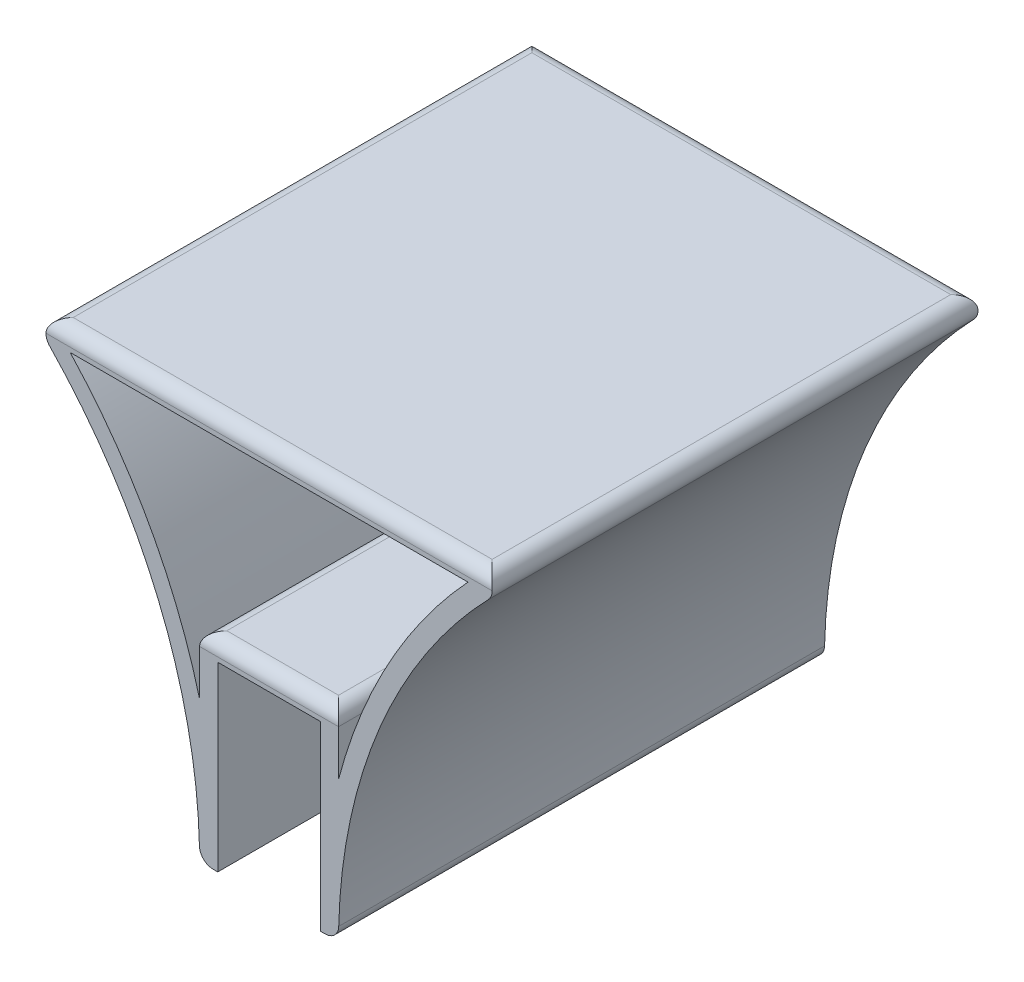
ISO-10303-21;
HEADER;
FILE_DESCRIPTION(('STEP AP214'),'2;1');
FILE_NAME('part.step','',(''),(''),'','','');
FILE_SCHEMA(('AUTOMOTIVE_DESIGN { 1 0 10303 214 1 1 1 1 }'));
ENDSEC;
DATA;
#1=APPLICATION_CONTEXT('core data for automotive mechanical design processes');
#2=APPLICATION_PROTOCOL_DEFINITION('international standard','automotive_design',2000,#1);
#3=PRODUCT_CONTEXT('',#1,'mechanical');
#4=PRODUCT('Part','Part','',(#3));
#5=PRODUCT_RELATED_PRODUCT_CATEGORY('part','',(#4));
#6=PRODUCT_DEFINITION_FORMATION('','',#4);
#7=PRODUCT_DEFINITION_CONTEXT('part definition',#1,'design');
#8=PRODUCT_DEFINITION('design','',#6,#7);
#9=PRODUCT_DEFINITION_SHAPE('','',#8);
#10=(LENGTH_UNIT() NAMED_UNIT(*) SI_UNIT(.MILLI.,.METRE.));
#11=(NAMED_UNIT(*) PLANE_ANGLE_UNIT() SI_UNIT($,.RADIAN.));
#12=(NAMED_UNIT(*) SI_UNIT($,.STERADIAN.) SOLID_ANGLE_UNIT());
#13=UNCERTAINTY_MEASURE_WITH_UNIT(LENGTH_MEASURE(1.E-05),#10,'distance_accuracy_value','');
#14=(GEOMETRIC_REPRESENTATION_CONTEXT(3) GLOBAL_UNCERTAINTY_ASSIGNED_CONTEXT((#13)) GLOBAL_UNIT_ASSIGNED_CONTEXT((#10,
#11,#12)) REPRESENTATION_CONTEXT('',''));
#15=CARTESIAN_POINT('',(0.,0.,0.));
#16=DIRECTION('',(0.,0.,1.));
#17=DIRECTION('',(1.,0.,0.));
#18=AXIS2_PLACEMENT_3D('',#15,#16,#17);
#19=CARTESIAN_POINT('',(11.3,0.,-53.5));
#20=DIRECTION('',(-1.,0.,0.));
#21=DIRECTION('',(0.,-1.,0.));
#22=AXIS2_PLACEMENT_3D('',#19,#20,#21);
#23=PLANE('',#22);
#24=DIRECTION('',(0.,-1.,0.));
#25=VECTOR('',#24,1.);
#26=CARTESIAN_POINT('',(11.3,0.,53.5));
#27=LINE('',#26,#25);
#28=CARTESIAN_POINT('',(11.3,0.,53.5));
#29=VERTEX_POINT('',#28);
#30=CARTESIAN_POINT('',(11.3,-40.,53.5));
#31=VERTEX_POINT('',#30);
#32=EDGE_CURVE('E235',#29,#31,#27,.T.);
#33=ORIENTED_EDGE('',*,*,#32,.F.);
#34=DIRECTION('',(0.,0.,1.));
#35=VECTOR('',#34,1.);
#36=CARTESIAN_POINT('',(11.3,0.,-53.5));
#37=LINE('',#36,#35);
#38=CARTESIAN_POINT('',(11.3,0.,-53.5));
#39=VERTEX_POINT('',#38);
#40=EDGE_CURVE('E279',#39,#29,#37,.T.);
#41=ORIENTED_EDGE('',*,*,#40,.F.);
#42=DIRECTION('',(0.,-1.,0.));
#43=VECTOR('',#42,1.);
#44=CARTESIAN_POINT('',(11.3,0.,-53.5));
#45=LINE('',#44,#43);
#46=CARTESIAN_POINT('',(11.3,-40.,-53.5));
#47=VERTEX_POINT('',#46);
#48=EDGE_CURVE('E239',#39,#47,#45,.T.);
#49=ORIENTED_EDGE('',*,*,#48,.T.);
#50=DIRECTION('',(0.,0.,1.));
#51=VECTOR('',#50,1.);
#52=CARTESIAN_POINT('',(11.3,-40.,-53.5));
#53=LINE('',#52,#51);
#54=EDGE_CURVE('E260',#47,#31,#53,.T.);
#55=ORIENTED_EDGE('',*,*,#54,.T.);
#56=EDGE_LOOP('',(#33,#41,#49,#55));
#57=FACE_BOUND('',#56,.T.);
#58=ADVANCED_FACE('F37',(#57),#23,.T.);
#59=CARTESIAN_POINT('',(-11.3,0.,-53.5));
#60=DIRECTION('',(0.,-1.,0.));
#61=DIRECTION('',(0.,0.,-1.));
#62=AXIS2_PLACEMENT_3D('',#59,#60,#61);
#63=PLANE('',#62);
#64=DIRECTION('',(1.,0.,0.));
#65=VECTOR('',#64,1.);
#66=CARTESIAN_POINT('',(-11.3,0.,53.5));
#67=LINE('',#66,#65);
#68=CARTESIAN_POINT('',(-11.3,0.,53.5));
#69=VERTEX_POINT('',#68);
#70=EDGE_CURVE('E243',#69,#29,#67,.T.);
#71=ORIENTED_EDGE('',*,*,#70,.F.);
#72=DIRECTION('',(0.,0.,1.));
#73=VECTOR('',#72,1.);
#74=CARTESIAN_POINT('',(-11.3,0.,-53.5));
#75=LINE('',#74,#73);
#76=CARTESIAN_POINT('',(-11.3,0.,-53.5));
#77=VERTEX_POINT('',#76);
#78=EDGE_CURVE('E282',#77,#69,#75,.T.);
#79=ORIENTED_EDGE('',*,*,#78,.F.);
#80=DIRECTION('',(1.,0.,0.));
#81=VECTOR('',#80,1.);
#82=CARTESIAN_POINT('',(-11.3,0.,-53.5));
#83=LINE('',#82,#81);
#84=EDGE_CURVE('E257',#77,#39,#83,.T.);
#85=ORIENTED_EDGE('',*,*,#84,.T.);
#86=ORIENTED_EDGE('',*,*,#40,.T.);
#87=EDGE_LOOP('',(#71,#79,#85,#86));
#88=FACE_BOUND('',#87,.T.);
#89=ADVANCED_FACE('F390',(#88),#63,.T.);
#90=CARTESIAN_POINT('',(-11.3,0.,-53.5));
#91=DIRECTION('',(1.,0.,0.));
#92=DIRECTION('',(0.,1.,0.));
#93=AXIS2_PLACEMENT_3D('',#90,#91,#92);
#94=PLANE('',#93);
#95=DIRECTION('',(0.,1.,0.));
#96=VECTOR('',#95,1.);
#97=CARTESIAN_POINT('',(-11.3,0.,53.5));
#98=LINE('',#97,#96);
#99=CARTESIAN_POINT('',(-11.3,-40.,53.5));
#100=VERTEX_POINT('',#99);
#101=EDGE_CURVE('E274',#100,#69,#98,.T.);
#102=ORIENTED_EDGE('',*,*,#101,.F.);
#103=DIRECTION('',(0.,0.,1.));
#104=VECTOR('',#103,1.);
#105=CARTESIAN_POINT('',(-11.3,-40.,-53.5));
#106=LINE('',#105,#104);
#107=CARTESIAN_POINT('',(-11.3,-40.,-53.5));
#108=VERTEX_POINT('',#107);
#109=EDGE_CURVE('E284',#108,#100,#106,.T.);
#110=ORIENTED_EDGE('',*,*,#109,.F.);
#111=DIRECTION('',(0.,1.,0.));
#112=VECTOR('',#111,1.);
#113=CARTESIAN_POINT('',(-11.3,0.,-53.5));
#114=LINE('',#113,#112);
#115=EDGE_CURVE('E254',#108,#77,#114,.T.);
#116=ORIENTED_EDGE('',*,*,#115,.T.);
#117=ORIENTED_EDGE('',*,*,#78,.T.);
#118=EDGE_LOOP('',(#102,#110,#116,#117));
#119=FACE_BOUND('',#118,.T.);
#120=ADVANCED_FACE('F394',(#119),#94,.T.);
#121=CARTESIAN_POINT('',(-11.3,-40.,-53.5));
#122=DIRECTION('',(0.,-1.,0.));
#123=DIRECTION('',(0.,0.,-1.));
#124=AXIS2_PLACEMENT_3D('',#121,#122,#123);
#125=PLANE('',#124);
#126=DIRECTION('',(1.,0.,0.));
#127=VECTOR('',#126,1.);
#128=CARTESIAN_POINT('',(-11.3,-40.,53.5));
#129=LINE('',#128,#127);
#130=CARTESIAN_POINT('',(-12.3372621005481,-40.,53.5));
#131=VERTEX_POINT('',#130);
#132=EDGE_CURVE('E272',#131,#100,#129,.T.);
#133=ORIENTED_EDGE('',*,*,#132,.F.);
#134=DIRECTION('',(0.,0.,1.));
#135=VECTOR('',#134,1.);
#136=CARTESIAN_POINT('',(-12.3372621005481,-40.,-53.5));
#137=LINE('',#136,#135);
#138=CARTESIAN_POINT('',(-12.3372621005481,-40.,-53.5));
#139=VERTEX_POINT('',#138);
#140=EDGE_CURVE('E46',#131,#139,#137,.F.);
#141=ORIENTED_EDGE('',*,*,#140,.T.);
#142=DIRECTION('',(1.,0.,0.));
#143=VECTOR('',#142,1.);
#144=CARTESIAN_POINT('',(-11.3,-40.,-53.5));
#145=LINE('',#144,#143);
#146=EDGE_CURVE('E252',#139,#108,#145,.T.);
#147=ORIENTED_EDGE('',*,*,#146,.T.);
#148=ORIENTED_EDGE('',*,*,#109,.T.);
#149=EDGE_LOOP('',(#133,#141,#147,#148));
#150=FACE_BOUND('',#149,.T.);
#151=ADVANCED_FACE('F492',(#150),#125,.T.);
#152=CARTESIAN_POINT('',(-133.084769668458,-40.,-53.5));
#153=DIRECTION('',(0.,0.,1.));
#154=DIRECTION('',(1.,0.,0.));
#155=AXIS2_PLACEMENT_3D('',#152,#153,#154);
#156=CYLINDRICAL_SURFACE('',#155,117.784769668458);
#157=CARTESIAN_POINT('',(-133.084769668458,-40.,53.5));
#158=DIRECTION('',(0.,0.,-1.));
#159=DIRECTION('',(1.,0.,0.));
#160=AXIS2_PLACEMENT_3D('',#157,#158,#159);
#161=CIRCLE('',#160,117.784769668458);
#162=CARTESIAN_POINT('',(-48.2880934679172,41.7482456765426,53.5));
#163=VERTEX_POINT('',#162);
#164=CARTESIAN_POINT('',(-15.3363366005704,-37.0745127057385,53.5));
#165=VERTEX_POINT('',#164);
#166=EDGE_CURVE('E269',#163,#165,#161,.T.);
#167=ORIENTED_EDGE('',*,*,#166,.F.);
#168=DIRECTION('',(0.,0.,1.));
#169=VECTOR('',#168,1.);
#170=CARTESIAN_POINT('',(-48.2880934679172,41.7482456765426,-53.5));
#171=LINE('',#170,#169);
#172=CARTESIAN_POINT('',(-48.2880934679172,41.7482456765426,-53.5));
#173=VERTEX_POINT('',#172);
#174=EDGE_CURVE('E334',#163,#173,#171,.F.);
#175=ORIENTED_EDGE('',*,*,#174,.T.);
#176=CARTESIAN_POINT('',(-133.084769668458,-40.,-53.5));
#177=DIRECTION('',(0.,0.,-1.));
#178=DIRECTION('',(1.,0.,0.));
#179=AXIS2_PLACEMENT_3D('',#176,#177,#178);
#180=CIRCLE('',#179,117.784769668458);
#181=CARTESIAN_POINT('',(-15.3363366005704,-37.0745127057385,-53.5));
#182=VERTEX_POINT('',#181);
#183=EDGE_CURVE('E249',#173,#182,#180,.T.);
#184=ORIENTED_EDGE('',*,*,#183,.T.);
#185=DIRECTION('',(0.,0.,1.));
#186=VECTOR('',#185,1.);
#187=CARTESIAN_POINT('',(-15.3363366005704,-37.0745127057385,-53.5));
#188=LINE('',#187,#186);
#189=EDGE_CURVE('E331',#182,#165,#188,.T.);
#190=ORIENTED_EDGE('',*,*,#189,.T.);
#191=EDGE_LOOP('',(#167,#175,#184,#190));
#192=FACE_BOUND('',#191,.T.);
#193=ADVANCED_FACE('F404',(#192),#156,.F.);
#194=CARTESIAN_POINT('',(53.5,46.8303887050508,-53.5));
#195=DIRECTION('',(0.,1.,0.));
#196=DIRECTION('',(0.,0.,1.));
#197=AXIS2_PLACEMENT_3D('',#194,#195,#196);
#198=PLANE('',#197);
#199=DIRECTION('',(-1.,0.,0.));
#200=VECTOR('',#199,1.);
#201=CARTESIAN_POINT('',(53.5,46.8303887050508,-50.5));
#202=LINE('',#201,#200);
#203=CARTESIAN_POINT('',(46.1283063467327,46.8303887050508,-50.5));
#204=VERTEX_POINT('',#203);
#205=CARTESIAN_POINT('',(-46.1283063467327,46.8303887050508,-50.5));
#206=VERTEX_POINT('',#205);
#207=EDGE_CURVE('E54',#204,#206,#202,.T.);
#208=ORIENTED_EDGE('',*,*,#207,.T.);
#209=DIRECTION('',(0.,0.,1.));
#210=VECTOR('',#209,1.);
#211=CARTESIAN_POINT('',(-46.1283063467327,46.8303887050508,-53.5));
#212=LINE('',#211,#210);
#213=CARTESIAN_POINT('',(-46.1283063467327,46.8303887050508,50.5));
#214=VERTEX_POINT('',#213);
#215=EDGE_CURVE('E329',#206,#214,#212,.T.);
#216=ORIENTED_EDGE('',*,*,#215,.T.);
#217=DIRECTION('',(-1.,0.,0.));
#218=VECTOR('',#217,1.);
#219=CARTESIAN_POINT('',(53.5,46.8303887050508,50.5));
#220=LINE('',#219,#218);
#221=CARTESIAN_POINT('',(46.1283063467327,46.8303887050508,50.5));
#222=VERTEX_POINT('',#221);
#223=EDGE_CURVE('E325',#214,#222,#220,.F.);
#224=ORIENTED_EDGE('',*,*,#223,.T.);
#225=DIRECTION('',(0.,0.,1.));
#226=VECTOR('',#225,1.);
#227=CARTESIAN_POINT('',(46.1283063467327,46.8303887050508,-53.5));
#228=LINE('',#227,#226);
#229=EDGE_CURVE('E59',#222,#204,#228,.F.);
#230=ORIENTED_EDGE('',*,*,#229,.T.);
#231=EDGE_LOOP('',(#208,#216,#224,#230));
#232=FACE_BOUND('',#231,.T.);
#233=ADVANCED_FACE('F414',(#232),#198,.T.);
#234=CARTESIAN_POINT('',(133.084769668458,-40.,-53.5));
#235=DIRECTION('',(0.,0.,1.));
#236=DIRECTION('',(1.,0.,0.));
#237=AXIS2_PLACEMENT_3D('',#234,#235,#236);
#238=CYLINDRICAL_SURFACE('',#237,117.784769668458);
#239=CARTESIAN_POINT('',(133.084769668458,-40.,-53.5));
#240=DIRECTION('',(0.,0.,-1.));
#241=DIRECTION('',(-1.,0.,0.));
#242=AXIS2_PLACEMENT_3D('',#239,#240,#241);
#243=CIRCLE('',#242,117.784769668458);
#244=CARTESIAN_POINT('',(15.3363366005704,-37.0745127057385,-53.5));
#245=VERTEX_POINT('',#244);
#246=CARTESIAN_POINT('',(48.2880934679172,41.7482456765426,-53.5));
#247=VERTEX_POINT('',#246);
#248=EDGE_CURVE('E246',#245,#247,#243,.T.);
#249=ORIENTED_EDGE('',*,*,#248,.T.);
#250=DIRECTION('',(0.,0.,1.));
#251=VECTOR('',#250,1.);
#252=CARTESIAN_POINT('',(48.2880934679172,41.7482456765426,-53.5));
#253=LINE('',#252,#251);
#254=CARTESIAN_POINT('',(48.2880934679172,41.7482456765426,53.5));
#255=VERTEX_POINT('',#254);
#256=EDGE_CURVE('E339',#247,#255,#253,.T.);
#257=ORIENTED_EDGE('',*,*,#256,.T.);
#258=CARTESIAN_POINT('',(133.084769668458,-40.,53.5));
#259=DIRECTION('',(0.,0.,-1.));
#260=DIRECTION('',(-1.,0.,0.));
#261=AXIS2_PLACEMENT_3D('',#258,#259,#260);
#262=CIRCLE('',#261,117.784769668458);
#263=CARTESIAN_POINT('',(15.3363366005704,-37.0745127057385,53.5));
#264=VERTEX_POINT('',#263);
#265=EDGE_CURVE('E266',#264,#255,#262,.T.);
#266=ORIENTED_EDGE('',*,*,#265,.F.);
#267=DIRECTION('',(0.,0.,1.));
#268=VECTOR('',#267,1.);
#269=CARTESIAN_POINT('',(15.3363366005704,-37.0745127057385,-53.5));
#270=LINE('',#269,#268);
#271=EDGE_CURVE('E337',#264,#245,#270,.F.);
#272=ORIENTED_EDGE('',*,*,#271,.T.);
#273=EDGE_LOOP('',(#249,#257,#266,#272));
#274=FACE_BOUND('',#273,.T.);
#275=ADVANCED_FACE('F374',(#274),#238,.F.);
#276=CARTESIAN_POINT('',(11.3,-40.,-53.5));
#277=DIRECTION('',(0.,-1.,0.));
#278=DIRECTION('',(0.,0.,-1.));
#279=AXIS2_PLACEMENT_3D('',#276,#277,#278);
#280=PLANE('',#279);
#281=DIRECTION('',(1.,0.,0.));
#282=VECTOR('',#281,1.);
#283=CARTESIAN_POINT('',(11.3,-40.,-53.5));
#284=LINE('',#283,#282);
#285=CARTESIAN_POINT('',(12.3372621005481,-40.,-53.5));
#286=VERTEX_POINT('',#285);
#287=EDGE_CURVE('E242',#47,#286,#284,.T.);
#288=ORIENTED_EDGE('',*,*,#287,.T.);
#289=DIRECTION('',(0.,0.,1.));
#290=VECTOR('',#289,1.);
#291=CARTESIAN_POINT('',(12.3372621005481,-40.,-53.5));
#292=LINE('',#291,#290);
#293=CARTESIAN_POINT('',(12.3372621005481,-40.,53.5));
#294=VERTEX_POINT('',#293);
#295=EDGE_CURVE('E11',#286,#294,#292,.T.);
#296=ORIENTED_EDGE('',*,*,#295,.T.);
#297=DIRECTION('',(1.,0.,0.));
#298=VECTOR('',#297,1.);
#299=CARTESIAN_POINT('',(11.3,-40.,53.5));
#300=LINE('',#299,#298);
#301=EDGE_CURVE('E263',#31,#294,#300,.T.);
#302=ORIENTED_EDGE('',*,*,#301,.F.);
#303=ORIENTED_EDGE('',*,*,#54,.F.);
#304=EDGE_LOOP('',(#288,#296,#302,#303));
#305=FACE_BOUND('',#304,.T.);
#306=ADVANCED_FACE('F382',(#305),#280,.T.);
#307=CARTESIAN_POINT('',(133.084769668458,-40.,-53.5));
#308=DIRECTION('',(0.,0.,-1.));
#309=DIRECTION('',(-1.,0.,0.));
#310=AXIS2_PLACEMENT_3D('',#307,#308,#309);
#311=PLANE('',#310);
#312=DIRECTION('',(0.,1.,0.));
#313=VECTOR('',#312,1.);
#314=CARTESIAN_POINT('',(-15.3,4.,-53.5));
#315=LINE('',#314,#313);
#316=CARTESIAN_POINT('',(-15.3,-9.04393181704647,-53.5));
#317=VERTEX_POINT('',#316);
#318=CARTESIAN_POINT('',(-15.3,1.,-53.5));
#319=VERTEX_POINT('',#318);
#320=EDGE_CURVE('E221',#317,#319,#315,.T.);
#321=ORIENTED_EDGE('',*,*,#320,.T.);
#322=DIRECTION('',(1.,0.,0.));
#323=VECTOR('',#322,1.);
#324=CARTESIAN_POINT('',(15.3,1.,-53.5));
#325=LINE('',#324,#323);
#326=CARTESIAN_POINT('',(15.3,1.,-53.5));
#327=VERTEX_POINT('',#326);
#328=EDGE_CURVE('E309',#319,#327,#325,.T.);
#329=ORIENTED_EDGE('',*,*,#328,.T.);
#330=DIRECTION('',(0.,-1.,0.));
#331=VECTOR('',#330,1.);
#332=CARTESIAN_POINT('',(15.3,4.,-53.5));
#333=LINE('',#332,#331);
#334=CARTESIAN_POINT('',(15.3,-9.04393181704647,-53.5));
#335=VERTEX_POINT('',#334);
#336=EDGE_CURVE('E200',#327,#335,#333,.T.);
#337=ORIENTED_EDGE('',*,*,#336,.T.);
#338=CARTESIAN_POINT('',(133.084769668458,-40.,-53.5));
#339=DIRECTION('',(0.,0.,-1.));
#340=DIRECTION('',(-1.,0.,0.));
#341=AXIS2_PLACEMENT_3D('',#338,#339,#340);
#342=CIRCLE('',#341,121.784769668458);
#343=CARTESIAN_POINT('',(43.8062345652789,42.8303887050508,-53.5));
#344=VERTEX_POINT('',#343);
#345=EDGE_CURVE('E193',#335,#344,#342,.T.);
#346=ORIENTED_EDGE('',*,*,#345,.T.);
#347=DIRECTION('',(-1.,0.,0.));
#348=VECTOR('',#347,1.);
#349=CARTESIAN_POINT('',(43.8062345652789,42.8303887050508,-53.5));
#350=LINE('',#349,#348);
#351=CARTESIAN_POINT('',(-43.8062345652789,42.8303887050508,-53.5));
#352=VERTEX_POINT('',#351);
#353=EDGE_CURVE('E204',#344,#352,#350,.T.);
#354=ORIENTED_EDGE('',*,*,#353,.T.);
#355=CARTESIAN_POINT('',(-133.084769668458,-40.,-53.5));
#356=DIRECTION('',(0.,0.,-1.));
#357=DIRECTION('',(1.,0.,0.));
#358=AXIS2_PLACEMENT_3D('',#355,#356,#357);
#359=CIRCLE('',#358,121.784769668458);
#360=EDGE_CURVE('E208',#352,#317,#359,.T.);
#361=ORIENTED_EDGE('',*,*,#360,.T.);
#362=EDGE_LOOP('',(#321,#329,#337,#346,#354,#361));
#363=FACE_BOUND('',#362,.T.);
#364=ORIENTED_EDGE('',*,*,#183,.F.);
#365=CARTESIAN_POINT('',(-46.1283063467327,43.8303887050508,-53.5));
#366=DIRECTION('',(0.,0.,-1.));
#367=DIRECTION('',(-1.,0.,0.));
#368=AXIS2_PLACEMENT_3D('',#365,#366,#367);
#369=CIRCLE('',#368,3.);
#370=CARTESIAN_POINT('',(-49.1283063467326,43.8303887050508,-53.5));
#371=VERTEX_POINT('',#370);
#372=EDGE_CURVE('E307',#173,#371,#369,.T.);
#373=ORIENTED_EDGE('',*,*,#372,.T.);
#374=DIRECTION('',(-1.,0.,0.));
#375=VECTOR('',#374,1.);
#376=CARTESIAN_POINT('',(133.084769668458,43.8303887050508,-53.5));
#377=LINE('',#376,#375);
#378=CARTESIAN_POINT('',(49.1283063467327,43.8303887050508,-53.5));
#379=VERTEX_POINT('',#378);
#380=EDGE_CURVE('E305',#371,#379,#377,.F.);
#381=ORIENTED_EDGE('',*,*,#380,.T.);
#382=CARTESIAN_POINT('',(46.1283063467327,43.8303887050508,-53.5));
#383=DIRECTION('',(0.,0.,-1.));
#384=DIRECTION('',(-1.,0.,0.));
#385=AXIS2_PLACEMENT_3D('',#382,#383,#384);
#386=CIRCLE('',#385,3.);
#387=EDGE_CURVE('E303',#379,#247,#386,.T.);
#388=ORIENTED_EDGE('',*,*,#387,.T.);
#389=ORIENTED_EDGE('',*,*,#248,.F.);
#390=CARTESIAN_POINT('',(12.3372621005481,-37.,-53.5));
#391=DIRECTION('',(0.,0.,-1.));
#392=DIRECTION('',(-1.,0.,0.));
#393=AXIS2_PLACEMENT_3D('',#390,#391,#392);
#394=CIRCLE('',#393,3.);
#395=EDGE_CURVE('E299',#245,#286,#394,.T.);
#396=ORIENTED_EDGE('',*,*,#395,.T.);
#397=ORIENTED_EDGE('',*,*,#287,.F.);
#398=ORIENTED_EDGE('',*,*,#48,.F.);
#399=ORIENTED_EDGE('',*,*,#84,.F.);
#400=ORIENTED_EDGE('',*,*,#115,.F.);
#401=ORIENTED_EDGE('',*,*,#146,.F.);
#402=CARTESIAN_POINT('',(-12.3372621005481,-37.,-53.5));
#403=DIRECTION('',(0.,0.,-1.));
#404=DIRECTION('',(-1.,0.,0.));
#405=AXIS2_PLACEMENT_3D('',#402,#403,#404);
#406=CIRCLE('',#405,3.);
#407=EDGE_CURVE('E301',#139,#182,#406,.T.);
#408=ORIENTED_EDGE('',*,*,#407,.T.);
#409=EDGE_LOOP('',(#364,#373,#381,#388,#389,#396,#397,#398,#399,#400,#401,#408));
#410=FACE_BOUND('',#409,.T.);
#411=ADVANCED_FACE('F211',(#363,#410),#311,.T.);
#412=CARTESIAN_POINT('',(133.084769668458,-40.,53.5));
#413=DIRECTION('',(0.,0.,-1.));
#414=DIRECTION('',(-1.,0.,0.));
#415=AXIS2_PLACEMENT_3D('',#412,#413,#414);
#416=PLANE('',#415);
#417=DIRECTION('',(0.,-1.,0.));
#418=VECTOR('',#417,1.);
#419=CARTESIAN_POINT('',(15.3,4.,53.5));
#420=LINE('',#419,#418);
#421=CARTESIAN_POINT('',(15.3,1.,53.5));
#422=VERTEX_POINT('',#421);
#423=CARTESIAN_POINT('',(15.3,-9.04393181704647,53.5));
#424=VERTEX_POINT('',#423);
#425=EDGE_CURVE('E215',#422,#424,#420,.T.);
#426=ORIENTED_EDGE('',*,*,#425,.F.);
#427=DIRECTION('',(1.,0.,0.));
#428=VECTOR('',#427,1.);
#429=CARTESIAN_POINT('',(133.084769668458,1.,53.5));
#430=LINE('',#429,#428);
#431=CARTESIAN_POINT('',(-15.3,1.,53.5));
#432=VERTEX_POINT('',#431);
#433=EDGE_CURVE('E323',#422,#432,#430,.F.);
#434=ORIENTED_EDGE('',*,*,#433,.T.);
#435=DIRECTION('',(0.,1.,0.));
#436=VECTOR('',#435,1.);
#437=CARTESIAN_POINT('',(-15.3,4.,53.5));
#438=LINE('',#437,#436);
#439=CARTESIAN_POINT('',(-15.3,-9.04393181704647,53.5));
#440=VERTEX_POINT('',#439);
#441=EDGE_CURVE('E217',#440,#432,#438,.T.);
#442=ORIENTED_EDGE('',*,*,#441,.F.);
#443=CARTESIAN_POINT('',(-133.084769668458,-40.,53.5));
#444=DIRECTION('',(0.,0.,-1.));
#445=DIRECTION('',(1.,0.,0.));
#446=AXIS2_PLACEMENT_3D('',#443,#444,#445);
#447=CIRCLE('',#446,121.784769668458);
#448=CARTESIAN_POINT('',(-43.8062345652789,42.8303887050508,53.5));
#449=VERTEX_POINT('',#448);
#450=EDGE_CURVE('E228',#449,#440,#447,.T.);
#451=ORIENTED_EDGE('',*,*,#450,.F.);
#452=DIRECTION('',(-1.,0.,0.));
#453=VECTOR('',#452,1.);
#454=CARTESIAN_POINT('',(43.8062345652789,42.8303887050508,53.5));
#455=LINE('',#454,#453);
#456=CARTESIAN_POINT('',(43.8062345652789,42.8303887050508,53.5));
#457=VERTEX_POINT('',#456);
#458=EDGE_CURVE('E225',#457,#449,#455,.T.);
#459=ORIENTED_EDGE('',*,*,#458,.F.);
#460=CARTESIAN_POINT('',(133.084769668458,-40.,53.5));
#461=DIRECTION('',(0.,0.,-1.));
#462=DIRECTION('',(-1.,0.,0.));
#463=AXIS2_PLACEMENT_3D('',#460,#461,#462);
#464=CIRCLE('',#463,121.784769668458);
#465=EDGE_CURVE('E195',#424,#457,#464,.T.);
#466=ORIENTED_EDGE('',*,*,#465,.F.);
#467=EDGE_LOOP('',(#426,#434,#442,#451,#459,#466));
#468=FACE_BOUND('',#467,.T.);
#469=DIRECTION('',(-1.,0.,0.));
#470=VECTOR('',#469,1.);
#471=CARTESIAN_POINT('',(-53.5,43.8303887050508,53.5));
#472=LINE('',#471,#470);
#473=CARTESIAN_POINT('',(49.1283063467327,43.8303887050508,53.5));
#474=VERTEX_POINT('',#473);
#475=CARTESIAN_POINT('',(-49.1283063467327,43.8303887050508,53.5));
#476=VERTEX_POINT('',#475);
#477=EDGE_CURVE('E317',#474,#476,#472,.T.);
#478=ORIENTED_EDGE('',*,*,#477,.T.);
#479=CARTESIAN_POINT('',(-46.1283063467327,43.8303887050508,53.5));
#480=DIRECTION('',(0.,0.,-1.));
#481=DIRECTION('',(-1.,0.,0.));
#482=AXIS2_PLACEMENT_3D('',#479,#480,#481);
#483=CIRCLE('',#482,3.);
#484=EDGE_CURVE('E321',#476,#163,#483,.F.);
#485=ORIENTED_EDGE('',*,*,#484,.T.);
#486=ORIENTED_EDGE('',*,*,#166,.T.);
#487=CARTESIAN_POINT('',(-12.3372621005481,-37.,53.5));
#488=DIRECTION('',(0.,0.,-1.));
#489=DIRECTION('',(-1.,0.,0.));
#490=AXIS2_PLACEMENT_3D('',#487,#488,#489);
#491=CIRCLE('',#490,3.);
#492=EDGE_CURVE('E315',#165,#131,#491,.F.);
#493=ORIENTED_EDGE('',*,*,#492,.T.);
#494=ORIENTED_EDGE('',*,*,#132,.T.);
#495=ORIENTED_EDGE('',*,*,#101,.T.);
#496=ORIENTED_EDGE('',*,*,#70,.T.);
#497=ORIENTED_EDGE('',*,*,#32,.T.);
#498=ORIENTED_EDGE('',*,*,#301,.T.);
#499=CARTESIAN_POINT('',(12.3372621005481,-37.,53.5));
#500=DIRECTION('',(0.,0.,-1.));
#501=DIRECTION('',(-1.,0.,0.));
#502=AXIS2_PLACEMENT_3D('',#499,#500,#501);
#503=CIRCLE('',#502,3.);
#504=EDGE_CURVE('E313',#294,#264,#503,.F.);
#505=ORIENTED_EDGE('',*,*,#504,.T.);
#506=ORIENTED_EDGE('',*,*,#265,.T.);
#507=CARTESIAN_POINT('',(46.1283063467327,43.8303887050508,53.5));
#508=DIRECTION('',(0.,0.,-1.));
#509=DIRECTION('',(-1.,0.,0.));
#510=AXIS2_PLACEMENT_3D('',#507,#508,#509);
#511=CIRCLE('',#510,3.);
#512=EDGE_CURVE('E319',#255,#474,#511,.F.);
#513=ORIENTED_EDGE('',*,*,#512,.T.);
#514=EDGE_LOOP('',(#478,#485,#486,#493,#494,#495,#496,#497,#498,#505,#506,#513));
#515=FACE_BOUND('',#514,.T.);
#516=ADVANCED_FACE('F407',(#468,#515),#416,.F.);
#517=CARTESIAN_POINT('',(133.084769668458,-40.,-53.5));
#518=DIRECTION('',(0.,0.,1.));
#519=DIRECTION('',(1.,0.,0.));
#520=AXIS2_PLACEMENT_3D('',#517,#518,#519);
#521=CYLINDRICAL_SURFACE('',#520,121.784769668458);
#522=ORIENTED_EDGE('',*,*,#465,.T.);
#523=DIRECTION('',(0.,0.,1.));
#524=VECTOR('',#523,1.);
#525=CARTESIAN_POINT('',(43.8062345652789,42.8303887050508,-53.5));
#526=LINE('',#525,#524);
#527=EDGE_CURVE('E188',#344,#457,#526,.T.);
#528=ORIENTED_EDGE('',*,*,#527,.F.);
#529=ORIENTED_EDGE('',*,*,#345,.F.);
#530=DIRECTION('',(0.,0.,1.));
#531=VECTOR('',#530,1.);
#532=CARTESIAN_POINT('',(15.3,-9.04393181704647,-53.5));
#533=LINE('',#532,#531);
#534=EDGE_CURVE('E233',#335,#424,#533,.T.);
#535=ORIENTED_EDGE('',*,*,#534,.T.);
#536=EDGE_LOOP('',(#522,#528,#529,#535));
#537=FACE_BOUND('',#536,.T.);
#538=ADVANCED_FACE('F190',(#537),#521,.T.);
#539=CARTESIAN_POINT('',(15.3,4.,-53.5));
#540=DIRECTION('',(-1.,0.,0.));
#541=DIRECTION('',(0.,-1.,0.));
#542=AXIS2_PLACEMENT_3D('',#539,#540,#541);
#543=PLANE('',#542);
#544=ORIENTED_EDGE('',*,*,#336,.F.);
#545=DIRECTION('',(0.,0.,1.));
#546=VECTOR('',#545,1.);
#547=CARTESIAN_POINT('',(15.3,1.,-53.5));
#548=LINE('',#547,#546);
#549=EDGE_CURVE('E311',#327,#422,#548,.T.);
#550=ORIENTED_EDGE('',*,*,#549,.T.);
#551=ORIENTED_EDGE('',*,*,#425,.T.);
#552=ORIENTED_EDGE('',*,*,#534,.F.);
#553=EDGE_LOOP('',(#544,#550,#551,#552));
#554=FACE_BOUND('',#553,.T.);
#555=ADVANCED_FACE('F473',(#554),#543,.F.);
#556=CARTESIAN_POINT('',(-15.3,4.,-53.5));
#557=DIRECTION('',(0.,-1.,0.));
#558=DIRECTION('',(0.,0.,-1.));
#559=AXIS2_PLACEMENT_3D('',#556,#557,#558);
#560=PLANE('',#559);
#561=DIRECTION('',(1.,0.,0.));
#562=VECTOR('',#561,1.);
#563=CARTESIAN_POINT('',(-15.3,4.,-50.5));
#564=LINE('',#563,#562);
#565=CARTESIAN_POINT('',(12.3,4.,-50.5));
#566=VERTEX_POINT('',#565);
#567=CARTESIAN_POINT('',(-12.3,4.,-50.5));
#568=VERTEX_POINT('',#567);
#569=EDGE_CURVE('E291',#566,#568,#564,.F.);
#570=ORIENTED_EDGE('',*,*,#569,.T.);
#571=DIRECTION('',(0.,0.,1.));
#572=VECTOR('',#571,1.);
#573=CARTESIAN_POINT('',(-12.3,4.,-53.5));
#574=LINE('',#573,#572);
#575=CARTESIAN_POINT('',(-12.3,4.,50.5));
#576=VERTEX_POINT('',#575);
#577=EDGE_CURVE('E293',#568,#576,#574,.T.);
#578=ORIENTED_EDGE('',*,*,#577,.T.);
#579=DIRECTION('',(1.,0.,0.));
#580=VECTOR('',#579,1.);
#581=CARTESIAN_POINT('',(-15.3,4.,50.5));
#582=LINE('',#581,#580);
#583=CARTESIAN_POINT('',(12.3,4.,50.5));
#584=VERTEX_POINT('',#583);
#585=EDGE_CURVE('E281',#576,#584,#582,.T.);
#586=ORIENTED_EDGE('',*,*,#585,.T.);
#587=DIRECTION('',(0.,0.,1.));
#588=VECTOR('',#587,1.);
#589=CARTESIAN_POINT('',(12.3,4.,-53.5));
#590=LINE('',#589,#588);
#591=EDGE_CURVE('E289',#584,#566,#590,.F.);
#592=ORIENTED_EDGE('',*,*,#591,.T.);
#593=EDGE_LOOP('',(#570,#578,#586,#592));
#594=FACE_BOUND('',#593,.T.);
#595=ADVANCED_FACE('F480',(#594),#560,.F.);
#596=CARTESIAN_POINT('',(-15.3,4.,-53.5));
#597=DIRECTION('',(1.,0.,0.));
#598=DIRECTION('',(0.,1.,0.));
#599=AXIS2_PLACEMENT_3D('',#596,#597,#598);
#600=PLANE('',#599);
#601=ORIENTED_EDGE('',*,*,#441,.T.);
#602=DIRECTION('',(0.,0.,1.));
#603=VECTOR('',#602,1.);
#604=CARTESIAN_POINT('',(-15.3,1.,-53.5));
#605=LINE('',#604,#603);
#606=EDGE_CURVE('E296',#432,#319,#605,.F.);
#607=ORIENTED_EDGE('',*,*,#606,.T.);
#608=ORIENTED_EDGE('',*,*,#320,.F.);
#609=DIRECTION('',(0.,0.,1.));
#610=VECTOR('',#609,1.);
#611=CARTESIAN_POINT('',(-15.3,-9.04393181704647,-53.5));
#612=LINE('',#611,#610);
#613=EDGE_CURVE('E236',#317,#440,#612,.T.);
#614=ORIENTED_EDGE('',*,*,#613,.T.);
#615=EDGE_LOOP('',(#601,#607,#608,#614));
#616=FACE_BOUND('',#615,.T.);
#617=ADVANCED_FACE('F466',(#616),#600,.F.);
#618=CARTESIAN_POINT('',(-133.084769668458,-40.,-53.5));
#619=DIRECTION('',(0.,0.,1.));
#620=DIRECTION('',(1.,0.,0.));
#621=AXIS2_PLACEMENT_3D('',#618,#619,#620);
#622=CYLINDRICAL_SURFACE('',#621,121.784769668458);
#623=ORIENTED_EDGE('',*,*,#450,.T.);
#624=ORIENTED_EDGE('',*,*,#613,.F.);
#625=ORIENTED_EDGE('',*,*,#360,.F.);
#626=DIRECTION('',(0.,0.,1.));
#627=VECTOR('',#626,1.);
#628=CARTESIAN_POINT('',(-43.8062345652789,42.8303887050508,-53.5));
#629=LINE('',#628,#627);
#630=EDGE_CURVE('E199',#352,#449,#629,.T.);
#631=ORIENTED_EDGE('',*,*,#630,.T.);
#632=EDGE_LOOP('',(#623,#624,#625,#631));
#633=FACE_BOUND('',#632,.T.);
#634=ADVANCED_FACE('F451',(#633),#622,.T.);
#635=CARTESIAN_POINT('',(43.8062345652789,42.8303887050508,-53.5));
#636=DIRECTION('',(0.,1.,0.));
#637=DIRECTION('',(0.,0.,1.));
#638=AXIS2_PLACEMENT_3D('',#635,#636,#637);
#639=PLANE('',#638);
#640=ORIENTED_EDGE('',*,*,#458,.T.);
#641=ORIENTED_EDGE('',*,*,#630,.F.);
#642=ORIENTED_EDGE('',*,*,#353,.F.);
#643=ORIENTED_EDGE('',*,*,#527,.T.);
#644=EDGE_LOOP('',(#640,#641,#642,#643));
#645=FACE_BOUND('',#644,.T.);
#646=ADVANCED_FACE('F205',(#645),#639,.F.);
#647=CARTESIAN_POINT('',(12.3,1.,-53.5));
#648=DIRECTION('',(0.,0.,1.));
#649=DIRECTION('',(1.,0.,0.));
#650=AXIS2_PLACEMENT_3D('',#647,#648,#649);
#651=CYLINDRICAL_SURFACE('',#650,3.);
#652=CARTESIAN_POINT('',(12.3,1.,50.5));
#653=DIRECTION('',(0.707106781186547,0.,-0.707106781186547));
#654=DIRECTION('',(0.707106781186547,0.,0.707106781186547));
#655=AXIS2_PLACEMENT_3D('',#652,#653,#654);
#656=ELLIPSE('',#655,4.24264068711928,3.);
#657=EDGE_CURVE('E346',#422,#584,#656,.F.);
#658=ORIENTED_EDGE('',*,*,#657,.F.);
#659=ORIENTED_EDGE('',*,*,#549,.F.);
#660=CARTESIAN_POINT('',(12.3,1.,-50.5));
#661=DIRECTION('',(0.707106781186547,0.,0.707106781186547));
#662=DIRECTION('',(-0.707106781186547,0.,0.707106781186547));
#663=AXIS2_PLACEMENT_3D('',#660,#661,#662);
#664=ELLIPSE('',#663,4.24264068711928,3.);
#665=EDGE_CURVE('E226',#566,#327,#664,.F.);
#666=ORIENTED_EDGE('',*,*,#665,.F.);
#667=ORIENTED_EDGE('',*,*,#591,.F.);
#668=EDGE_LOOP('',(#658,#659,#666,#667));
#669=FACE_BOUND('',#668,.T.);
#670=ADVANCED_FACE('F444',(#669),#651,.T.);
#671=CARTESIAN_POINT('',(133.084769668458,1.,-50.5));
#672=DIRECTION('',(-1.,0.,0.));
#673=DIRECTION('',(0.,0.,1.));
#674=AXIS2_PLACEMENT_3D('',#671,#672,#673);
#675=CYLINDRICAL_SURFACE('',#674,3.);
#676=ORIENTED_EDGE('',*,*,#665,.T.);
#677=ORIENTED_EDGE('',*,*,#328,.F.);
#678=CARTESIAN_POINT('',(-12.3,1.,-50.5));
#679=DIRECTION('',(-0.707106781186547,0.,0.707106781186547));
#680=DIRECTION('',(-0.707106781186547,0.,-0.707106781186547));
#681=AXIS2_PLACEMENT_3D('',#678,#679,#680);
#682=ELLIPSE('',#681,4.24264068711928,3.);
#683=EDGE_CURVE('E344',#568,#319,#682,.T.);
#684=ORIENTED_EDGE('',*,*,#683,.F.);
#685=ORIENTED_EDGE('',*,*,#569,.F.);
#686=EDGE_LOOP('',(#676,#677,#684,#685));
#687=FACE_BOUND('',#686,.T.);
#688=ADVANCED_FACE('F440',(#687),#675,.T.);
#689=CARTESIAN_POINT('',(-15.3,1.,50.5));
#690=DIRECTION('',(1.,0.,0.));
#691=DIRECTION('',(0.,0.,-1.));
#692=AXIS2_PLACEMENT_3D('',#689,#690,#691);
#693=CYLINDRICAL_SURFACE('',#692,3.);
#694=ORIENTED_EDGE('',*,*,#657,.T.);
#695=ORIENTED_EDGE('',*,*,#585,.F.);
#696=CARTESIAN_POINT('',(-12.3,1.,50.5));
#697=DIRECTION('',(0.707106781186547,0.,0.707106781186547));
#698=DIRECTION('',(0.707106781186547,0.,-0.707106781186547));
#699=AXIS2_PLACEMENT_3D('',#696,#697,#698);
#700=ELLIPSE('',#699,4.24264068711928,3.);
#701=EDGE_CURVE('E342',#432,#576,#700,.F.);
#702=ORIENTED_EDGE('',*,*,#701,.F.);
#703=ORIENTED_EDGE('',*,*,#433,.F.);
#704=EDGE_LOOP('',(#694,#695,#702,#703));
#705=FACE_BOUND('',#704,.T.);
#706=ADVANCED_FACE('F436',(#705),#693,.T.);
#707=CARTESIAN_POINT('',(-12.3,1.,-53.5));
#708=DIRECTION('',(0.,0.,1.));
#709=DIRECTION('',(1.,0.,0.));
#710=AXIS2_PLACEMENT_3D('',#707,#708,#709);
#711=CYLINDRICAL_SURFACE('',#710,3.);
#712=ORIENTED_EDGE('',*,*,#683,.T.);
#713=ORIENTED_EDGE('',*,*,#606,.F.);
#714=ORIENTED_EDGE('',*,*,#701,.T.);
#715=ORIENTED_EDGE('',*,*,#577,.F.);
#716=EDGE_LOOP('',(#712,#713,#714,#715));
#717=FACE_BOUND('',#716,.T.);
#718=ADVANCED_FACE('F433',(#717),#711,.T.);
#719=CARTESIAN_POINT('',(46.1283063467327,43.8303887050508,-53.5));
#720=DIRECTION('',(0.,0.,1.));
#721=DIRECTION('',(1.,0.,0.));
#722=AXIS2_PLACEMENT_3D('',#719,#720,#721);
#723=CYLINDRICAL_SURFACE('',#722,3.);
#724=ORIENTED_EDGE('',*,*,#256,.F.);
#725=ORIENTED_EDGE('',*,*,#387,.F.);
#726=CARTESIAN_POINT('',(46.1283063467327,43.8303887050508,-50.5));
#727=DIRECTION('',(0.707106781186547,0.,0.707106781186547));
#728=DIRECTION('',(-0.707106781186547,0.,0.707106781186547));
#729=AXIS2_PLACEMENT_3D('',#726,#727,#728);
#730=ELLIPSE('',#729,4.24264068711928,3.);
#731=EDGE_CURVE('E41',#204,#379,#730,.F.);
#732=ORIENTED_EDGE('',*,*,#731,.F.);
#733=ORIENTED_EDGE('',*,*,#229,.F.);
#734=CARTESIAN_POINT('',(46.1283063467327,43.8303887050508,50.5));
#735=DIRECTION('',(0.707106781186547,0.,-0.707106781186547));
#736=DIRECTION('',(0.707106781186547,0.,0.707106781186547));
#737=AXIS2_PLACEMENT_3D('',#734,#735,#736);
#738=ELLIPSE('',#737,4.24264068711928,3.);
#739=EDGE_CURVE('E355',#474,#222,#738,.F.);
#740=ORIENTED_EDGE('',*,*,#739,.F.);
#741=ORIENTED_EDGE('',*,*,#512,.F.);
#742=EDGE_LOOP('',(#724,#725,#732,#733,#740,#741));
#743=FACE_BOUND('',#742,.T.);
#744=ADVANCED_FACE('F368',(#743),#723,.T.);
#745=CARTESIAN_POINT('',(53.5,43.8303887050508,-50.5));
#746=DIRECTION('',(-1.,0.,0.));
#747=DIRECTION('',(0.,0.,1.));
#748=AXIS2_PLACEMENT_3D('',#745,#746,#747);
#749=CYLINDRICAL_SURFACE('',#748,3.);
#750=ORIENTED_EDGE('',*,*,#731,.T.);
#751=ORIENTED_EDGE('',*,*,#380,.F.);
#752=CARTESIAN_POINT('',(-46.1283063467327,43.8303887050508,-50.5));
#753=DIRECTION('',(-0.707106781186547,0.,0.707106781186547));
#754=DIRECTION('',(-0.707106781186547,0.,-0.707106781186547));
#755=AXIS2_PLACEMENT_3D('',#752,#753,#754);
#756=ELLIPSE('',#755,4.24264068711928,3.);
#757=EDGE_CURVE('E353',#206,#371,#756,.T.);
#758=ORIENTED_EDGE('',*,*,#757,.F.);
#759=ORIENTED_EDGE('',*,*,#207,.F.);
#760=EDGE_LOOP('',(#750,#751,#758,#759));
#761=FACE_BOUND('',#760,.T.);
#762=ADVANCED_FACE('F364',(#761),#749,.T.);
#763=CARTESIAN_POINT('',(133.084769668458,43.8303887050508,50.5));
#764=DIRECTION('',(1.,0.,0.));
#765=DIRECTION('',(0.,0.,-1.));
#766=AXIS2_PLACEMENT_3D('',#763,#764,#765);
#767=CYLINDRICAL_SURFACE('',#766,3.);
#768=ORIENTED_EDGE('',*,*,#739,.T.);
#769=ORIENTED_EDGE('',*,*,#223,.F.);
#770=CARTESIAN_POINT('',(-46.1283063467327,43.8303887050508,50.5));
#771=DIRECTION('',(0.707106781186547,0.,0.707106781186547));
#772=DIRECTION('',(0.707106781186547,0.,-0.707106781186547));
#773=AXIS2_PLACEMENT_3D('',#770,#771,#772);
#774=ELLIPSE('',#773,4.24264068711928,3.);
#775=EDGE_CURVE('E351',#476,#214,#774,.F.);
#776=ORIENTED_EDGE('',*,*,#775,.F.);
#777=ORIENTED_EDGE('',*,*,#477,.F.);
#778=EDGE_LOOP('',(#768,#769,#776,#777));
#779=FACE_BOUND('',#778,.T.);
#780=ADVANCED_FACE('F415',(#779),#767,.T.);
#781=CARTESIAN_POINT('',(-46.1283063467327,43.8303887050508,-53.5));
#782=DIRECTION('',(0.,0.,1.));
#783=DIRECTION('',(1.,0.,0.));
#784=AXIS2_PLACEMENT_3D('',#781,#782,#783);
#785=CYLINDRICAL_SURFACE('',#784,3.);
#786=ORIENTED_EDGE('',*,*,#372,.F.);
#787=ORIENTED_EDGE('',*,*,#174,.F.);
#788=ORIENTED_EDGE('',*,*,#484,.F.);
#789=ORIENTED_EDGE('',*,*,#775,.T.);
#790=ORIENTED_EDGE('',*,*,#215,.F.);
#791=ORIENTED_EDGE('',*,*,#757,.T.);
#792=EDGE_LOOP('',(#786,#787,#788,#789,#790,#791));
#793=FACE_BOUND('',#792,.T.);
#794=ADVANCED_FACE('F412',(#793),#785,.T.);
#795=CARTESIAN_POINT('',(-12.3372621005481,-37.,-53.5));
#796=DIRECTION('',(0.,0.,1.));
#797=DIRECTION('',(1.,0.,0.));
#798=AXIS2_PLACEMENT_3D('',#795,#796,#797);
#799=CYLINDRICAL_SURFACE('',#798,3.);
#800=ORIENTED_EDGE('',*,*,#407,.F.);
#801=ORIENTED_EDGE('',*,*,#140,.F.);
#802=ORIENTED_EDGE('',*,*,#492,.F.);
#803=ORIENTED_EDGE('',*,*,#189,.F.);
#804=EDGE_LOOP('',(#800,#801,#802,#803));
#805=FACE_BOUND('',#804,.T.);
#806=ADVANCED_FACE('F401',(#805),#799,.T.);
#807=CARTESIAN_POINT('',(12.3372621005481,-37.,-53.5));
#808=DIRECTION('',(0.,0.,1.));
#809=DIRECTION('',(1.,0.,0.));
#810=AXIS2_PLACEMENT_3D('',#807,#808,#809);
#811=CYLINDRICAL_SURFACE('',#810,3.);
#812=ORIENTED_EDGE('',*,*,#395,.F.);
#813=ORIENTED_EDGE('',*,*,#271,.F.);
#814=ORIENTED_EDGE('',*,*,#504,.F.);
#815=ORIENTED_EDGE('',*,*,#295,.F.);
#816=EDGE_LOOP('',(#812,#813,#814,#815));
#817=FACE_BOUND('',#816,.T.);
#818=ADVANCED_FACE('F39',(#817),#811,.T.);
#819=CLOSED_SHELL('',(#58,#89,#120,#151,#193,#233,#275,#306,#411,#516,#538,#555,#595,#617,#634,
#646,#670,#688,#706,#718,#744,#762,#780,#794,#806,#818));
#820=MANIFOLD_SOLID_BREP('B2',#819);
#821=ADVANCED_BREP_SHAPE_REPRESENTATION('',(#18,#820),#14);
#822=SHAPE_DEFINITION_REPRESENTATION(#9,#821);
ENDSEC;
END-ISO-10303-21;
